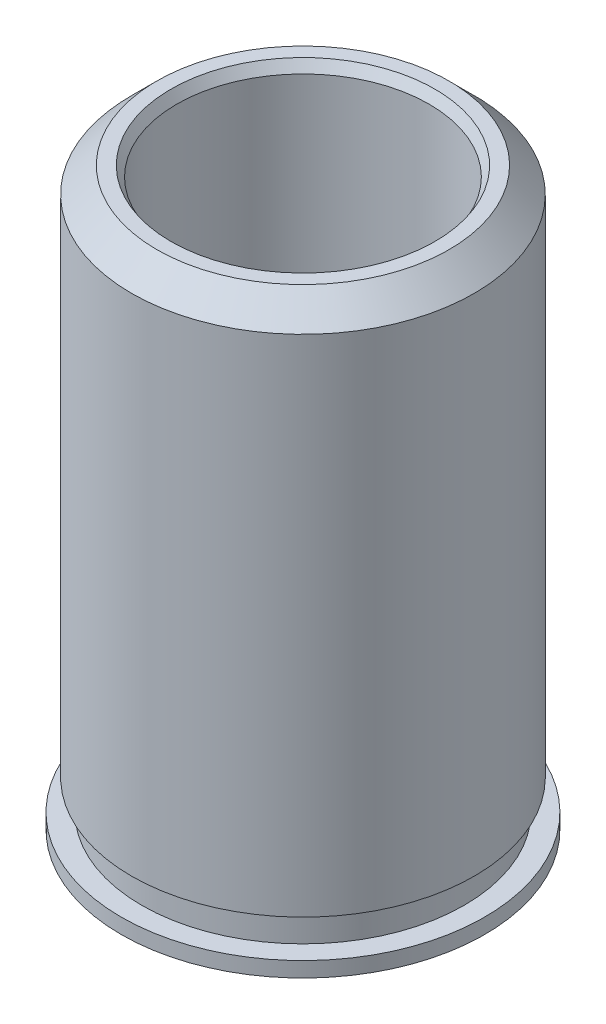
ISO-10303-21;
HEADER;
FILE_DESCRIPTION(('STEP AP214'),'2;1');
FILE_NAME('part.step','',(''),(''),'','','');
FILE_SCHEMA(('AUTOMOTIVE_DESIGN { 1 0 10303 214 1 1 1 1 }'));
ENDSEC;
DATA;
#1=APPLICATION_CONTEXT('core data for automotive mechanical design processes');
#2=APPLICATION_PROTOCOL_DEFINITION('international standard','automotive_design',2000,#1);
#3=PRODUCT_CONTEXT('',#1,'mechanical');
#4=PRODUCT('Part','Part','',(#3));
#5=PRODUCT_RELATED_PRODUCT_CATEGORY('part','',(#4));
#6=PRODUCT_DEFINITION_FORMATION('','',#4);
#7=PRODUCT_DEFINITION_CONTEXT('part definition',#1,'design');
#8=PRODUCT_DEFINITION('design','',#6,#7);
#9=PRODUCT_DEFINITION_SHAPE('','',#8);
#10=(LENGTH_UNIT() NAMED_UNIT(*) SI_UNIT(.MILLI.,.METRE.));
#11=(NAMED_UNIT(*) PLANE_ANGLE_UNIT() SI_UNIT($,.RADIAN.));
#12=(NAMED_UNIT(*) SI_UNIT($,.STERADIAN.) SOLID_ANGLE_UNIT());
#13=UNCERTAINTY_MEASURE_WITH_UNIT(LENGTH_MEASURE(1.E-05),#10,'distance_accuracy_value','');
#14=(GEOMETRIC_REPRESENTATION_CONTEXT(3) GLOBAL_UNCERTAINTY_ASSIGNED_CONTEXT((#13)) GLOBAL_UNIT_ASSIGNED_CONTEXT((#10,
#11,#12)) REPRESENTATION_CONTEXT('',''));
#15=CARTESIAN_POINT('',(0.,0.,0.));
#16=DIRECTION('',(0.,0.,1.));
#17=DIRECTION('',(1.,0.,0.));
#18=AXIS2_PLACEMENT_3D('',#15,#16,#17);
#19=CARTESIAN_POINT('',(0.,7.239,0.));
#20=DIRECTION('',(0.,1.,0.));
#21=DIRECTION('',(0.,0.,1.));
#22=AXIS2_PLACEMENT_3D('',#19,#20,#21);
#23=CYLINDRICAL_SURFACE('',#22,4.572);
#24=CARTESIAN_POINT('',(0.,-7.239,0.));
#25=DIRECTION('',(0.,1.,0.));
#26=DIRECTION('',(0.,0.,1.));
#27=AXIS2_PLACEMENT_3D('',#24,#25,#26);
#28=CIRCLE('',#27,4.572);
#29=CARTESIAN_POINT('',(0.,-7.239,4.572));
#30=VERTEX_POINT('',#29);
#31=EDGE_CURVE('E51',#30,#30,#28,.T.);
#32=ORIENTED_EDGE('',*,*,#31,.T.);
#33=EDGE_LOOP('',(#32));
#34=FACE_BOUND('',#33,.T.);
#35=CARTESIAN_POINT('',(0.,-6.858,0.));
#36=DIRECTION('',(0.,1.,0.));
#37=DIRECTION('',(0.,0.,1.));
#38=AXIS2_PLACEMENT_3D('',#35,#36,#37);
#39=CIRCLE('',#38,4.572);
#40=CARTESIAN_POINT('',(0.,-6.858,4.572));
#41=VERTEX_POINT('',#40);
#42=EDGE_CURVE('E10',#41,#41,#39,.T.);
#43=ORIENTED_EDGE('',*,*,#42,.F.);
#44=EDGE_LOOP('',(#43));
#45=FACE_BOUND('',#44,.T.);
#46=ADVANCED_FACE('F14',(#34,#45),#23,.T.);
#47=CARTESIAN_POINT('',(2.286,-6.858,0.));
#48=DIRECTION('',(0.,1.,0.));
#49=DIRECTION('',(0.,0.,1.));
#50=AXIS2_PLACEMENT_3D('',#47,#48,#49);
#51=PLANE('',#50);
#52=ORIENTED_EDGE('',*,*,#42,.T.);
#53=EDGE_LOOP('',(#52));
#54=FACE_BOUND('',#53,.T.);
#55=CARTESIAN_POINT('',(0.,-6.858,0.));
#56=DIRECTION('',(0.,1.,0.));
#57=DIRECTION('',(0.,0.,1.));
#58=AXIS2_PLACEMENT_3D('',#55,#56,#57);
#59=CIRCLE('',#58,4.05765);
#60=CARTESIAN_POINT('',(0.,-6.858,4.05765));
#61=VERTEX_POINT('',#60);
#62=EDGE_CURVE('E20',#61,#61,#59,.T.);
#63=ORIENTED_EDGE('',*,*,#62,.F.);
#64=EDGE_LOOP('',(#63));
#65=FACE_BOUND('',#64,.T.);
#66=ADVANCED_FACE('F76',(#54,#65),#51,.T.);
#67=CARTESIAN_POINT('',(0.,7.239,0.));
#68=DIRECTION('',(0.,1.,0.));
#69=DIRECTION('',(0.,0.,1.));
#70=AXIS2_PLACEMENT_3D('',#67,#68,#69);
#71=CYLINDRICAL_SURFACE('',#70,4.05765);
#72=ORIENTED_EDGE('',*,*,#62,.T.);
#73=EDGE_LOOP('',(#72));
#74=FACE_BOUND('',#73,.T.);
#75=CARTESIAN_POINT('',(0.,-6.096,0.));
#76=DIRECTION('',(0.,1.,0.));
#77=DIRECTION('',(0.,0.,1.));
#78=AXIS2_PLACEMENT_3D('',#75,#76,#77);
#79=CIRCLE('',#78,4.05765);
#80=CARTESIAN_POINT('',(0.,-6.096,4.05765));
#81=VERTEX_POINT('',#80);
#82=EDGE_CURVE('E24',#81,#81,#79,.T.);
#83=ORIENTED_EDGE('',*,*,#82,.F.);
#84=EDGE_LOOP('',(#83));
#85=FACE_BOUND('',#84,.T.);
#86=ADVANCED_FACE('F80',(#74,#85),#71,.T.);
#87=CARTESIAN_POINT('',(2.286,-6.096,0.));
#88=DIRECTION('',(0.,-1.,0.));
#89=DIRECTION('',(0.,0.,-1.));
#90=AXIS2_PLACEMENT_3D('',#87,#88,#89);
#91=PLANE('',#90);
#92=ORIENTED_EDGE('',*,*,#82,.T.);
#93=EDGE_LOOP('',(#92));
#94=FACE_BOUND('',#93,.T.);
#95=CARTESIAN_POINT('',(0.,-6.096,0.));
#96=DIRECTION('',(0.,1.,0.));
#97=DIRECTION('',(0.,0.,1.));
#98=AXIS2_PLACEMENT_3D('',#95,#96,#97);
#99=CIRCLE('',#98,4.31165);
#100=CARTESIAN_POINT('',(0.,-6.096,4.31165));
#101=VERTEX_POINT('',#100);
#102=EDGE_CURVE('E28',#101,#101,#99,.T.);
#103=ORIENTED_EDGE('',*,*,#102,.F.);
#104=EDGE_LOOP('',(#103));
#105=FACE_BOUND('',#104,.T.);
#106=ADVANCED_FACE('F84',(#94,#105),#91,.T.);
#107=CARTESIAN_POINT('',(0.,7.239,0.));
#108=DIRECTION('',(0.,1.,0.));
#109=DIRECTION('',(0.,0.,1.));
#110=AXIS2_PLACEMENT_3D('',#107,#108,#109);
#111=CYLINDRICAL_SURFACE('',#110,4.31165);
#112=ORIENTED_EDGE('',*,*,#102,.T.);
#113=EDGE_LOOP('',(#112));
#114=FACE_BOUND('',#113,.T.);
#115=CARTESIAN_POINT('',(0.,6.604,0.));
#116=DIRECTION('',(0.,1.,0.));
#117=DIRECTION('',(0.,0.,1.));
#118=AXIS2_PLACEMENT_3D('',#115,#116,#117);
#119=CIRCLE('',#118,4.31164999999999);
#120=CARTESIAN_POINT('',(0.,6.604,4.31164999999999));
#121=VERTEX_POINT('',#120);
#122=EDGE_CURVE('E33',#121,#121,#119,.T.);
#123=ORIENTED_EDGE('',*,*,#122,.F.);
#124=EDGE_LOOP('',(#123));
#125=FACE_BOUND('',#124,.T.);
#126=ADVANCED_FACE('F90',(#114,#125),#111,.T.);
#127=CARTESIAN_POINT('',(0.,7.239,0.));
#128=DIRECTION('',(0.,-1.,0.));
#129=DIRECTION('',(0.,0.,-1.));
#130=AXIS2_PLACEMENT_3D('',#127,#128,#129);
#131=CONICAL_SURFACE('',#130,3.67665,0.785398163397446);
#132=ORIENTED_EDGE('',*,*,#122,.T.);
#133=EDGE_LOOP('',(#132));
#134=FACE_BOUND('',#133,.T.);
#135=CARTESIAN_POINT('',(0.,7.239,0.));
#136=DIRECTION('',(0.,1.,0.));
#137=DIRECTION('',(0.,0.,1.));
#138=AXIS2_PLACEMENT_3D('',#135,#136,#137);
#139=CIRCLE('',#138,3.67665);
#140=CARTESIAN_POINT('',(0.,7.239,3.67665));
#141=VERTEX_POINT('',#140);
#142=EDGE_CURVE('E36',#141,#141,#139,.T.);
#143=ORIENTED_EDGE('',*,*,#142,.F.);
#144=EDGE_LOOP('',(#143));
#145=FACE_BOUND('',#144,.T.);
#146=ADVANCED_FACE('F94',(#134,#145),#131,.T.);
#147=CARTESIAN_POINT('',(2.286,7.239,0.));
#148=DIRECTION('',(0.,1.,0.));
#149=DIRECTION('',(0.,0.,1.));
#150=AXIS2_PLACEMENT_3D('',#147,#148,#149);
#151=PLANE('',#150);
#152=ORIENTED_EDGE('',*,*,#142,.T.);
#153=EDGE_LOOP('',(#152));
#154=FACE_BOUND('',#153,.T.);
#155=CARTESIAN_POINT('',(0.,7.239,0.));
#156=DIRECTION('',(0.,1.,0.));
#157=DIRECTION('',(0.,0.,1.));
#158=AXIS2_PLACEMENT_3D('',#155,#156,#157);
#159=CIRCLE('',#158,3.32164696837416);
#160=CARTESIAN_POINT('',(0.,7.239,3.32164696837416));
#161=VERTEX_POINT('',#160);
#162=EDGE_CURVE('E39',#161,#161,#159,.T.);
#163=ORIENTED_EDGE('',*,*,#162,.F.);
#164=EDGE_LOOP('',(#163));
#165=FACE_BOUND('',#164,.T.);
#166=ADVANCED_FACE('F98',(#154,#165),#151,.T.);
#167=CARTESIAN_POINT('',(0.,6.985,0.));
#168=DIRECTION('',(0.,1.,0.));
#169=DIRECTION('',(0.,0.,1.));
#170=AXIS2_PLACEMENT_3D('',#167,#168,#169);
#171=CONICAL_SURFACE('',#170,3.175,0.523598775598296);
#172=ORIENTED_EDGE('',*,*,#162,.T.);
#173=EDGE_LOOP('',(#172));
#174=FACE_BOUND('',#173,.T.);
#175=CARTESIAN_POINT('',(0.,6.985,0.));
#176=DIRECTION('',(0.,1.,0.));
#177=DIRECTION('',(0.,0.,1.));
#178=AXIS2_PLACEMENT_3D('',#175,#176,#177);
#179=CIRCLE('',#178,3.175);
#180=CARTESIAN_POINT('',(0.,6.985,3.175));
#181=VERTEX_POINT('',#180);
#182=EDGE_CURVE('E42',#181,#181,#179,.T.);
#183=ORIENTED_EDGE('',*,*,#182,.F.);
#184=EDGE_LOOP('',(#183));
#185=FACE_BOUND('',#184,.T.);
#186=ADVANCED_FACE('F72',(#174,#185),#171,.F.);
#187=CARTESIAN_POINT('',(0.,7.239,0.));
#188=DIRECTION('',(0.,1.,0.));
#189=DIRECTION('',(0.,0.,1.));
#190=AXIS2_PLACEMENT_3D('',#187,#188,#189);
#191=CYLINDRICAL_SURFACE('',#190,3.175);
#192=ORIENTED_EDGE('',*,*,#182,.T.);
#193=EDGE_LOOP('',(#192));
#194=FACE_BOUND('',#193,.T.);
#195=CARTESIAN_POINT('',(0.,-6.985,0.));
#196=DIRECTION('',(0.,1.,0.));
#197=DIRECTION('',(0.,0.,1.));
#198=AXIS2_PLACEMENT_3D('',#195,#196,#197);
#199=CIRCLE('',#198,3.175);
#200=CARTESIAN_POINT('',(0.,-6.985,3.175));
#201=VERTEX_POINT('',#200);
#202=EDGE_CURVE('E45',#201,#201,#199,.T.);
#203=ORIENTED_EDGE('',*,*,#202,.F.);
#204=EDGE_LOOP('',(#203));
#205=FACE_BOUND('',#204,.T.);
#206=ADVANCED_FACE('F65',(#194,#205),#191,.F.);
#207=CARTESIAN_POINT('',(0.,-7.239,0.));
#208=DIRECTION('',(0.,-1.,0.));
#209=DIRECTION('',(0.,0.,-1.));
#210=AXIS2_PLACEMENT_3D('',#207,#208,#209);
#211=CONICAL_SURFACE('',#210,3.32164696837416,0.523598775598303);
#212=ORIENTED_EDGE('',*,*,#202,.T.);
#213=EDGE_LOOP('',(#212));
#214=FACE_BOUND('',#213,.T.);
#215=CARTESIAN_POINT('',(0.,-7.239,0.));
#216=DIRECTION('',(0.,1.,0.));
#217=DIRECTION('',(0.,0.,1.));
#218=AXIS2_PLACEMENT_3D('',#215,#216,#217);
#219=CIRCLE('',#218,3.32164696837416);
#220=CARTESIAN_POINT('',(0.,-7.239,3.32164696837416));
#221=VERTEX_POINT('',#220);
#222=EDGE_CURVE('E48',#221,#221,#219,.T.);
#223=ORIENTED_EDGE('',*,*,#222,.F.);
#224=EDGE_LOOP('',(#223));
#225=FACE_BOUND('',#224,.T.);
#226=ADVANCED_FACE('F60',(#214,#225),#211,.F.);
#227=CARTESIAN_POINT('',(2.286,-7.239,0.));
#228=DIRECTION('',(0.,1.,0.));
#229=DIRECTION('',(0.,0.,1.));
#230=AXIS2_PLACEMENT_3D('',#227,#228,#229);
#231=PLANE('',#230);
#232=ORIENTED_EDGE('',*,*,#31,.F.);
#233=EDGE_LOOP('',(#232));
#234=FACE_BOUND('',#233,.T.);
#235=ORIENTED_EDGE('',*,*,#222,.T.);
#236=EDGE_LOOP('',(#235));
#237=FACE_BOUND('',#236,.T.);
#238=ADVANCED_FACE('F57',(#234,#237),#231,.F.);
#239=CLOSED_SHELL('',(#46,#66,#86,#106,#126,#146,#166,#186,#206,#226,#238));
#240=MANIFOLD_SOLID_BREP('B1',#239);
#241=ADVANCED_BREP_SHAPE_REPRESENTATION('',(#18,#240),#14);
#242=SHAPE_DEFINITION_REPRESENTATION(#9,#241);
ENDSEC;
END-ISO-10303-21;
